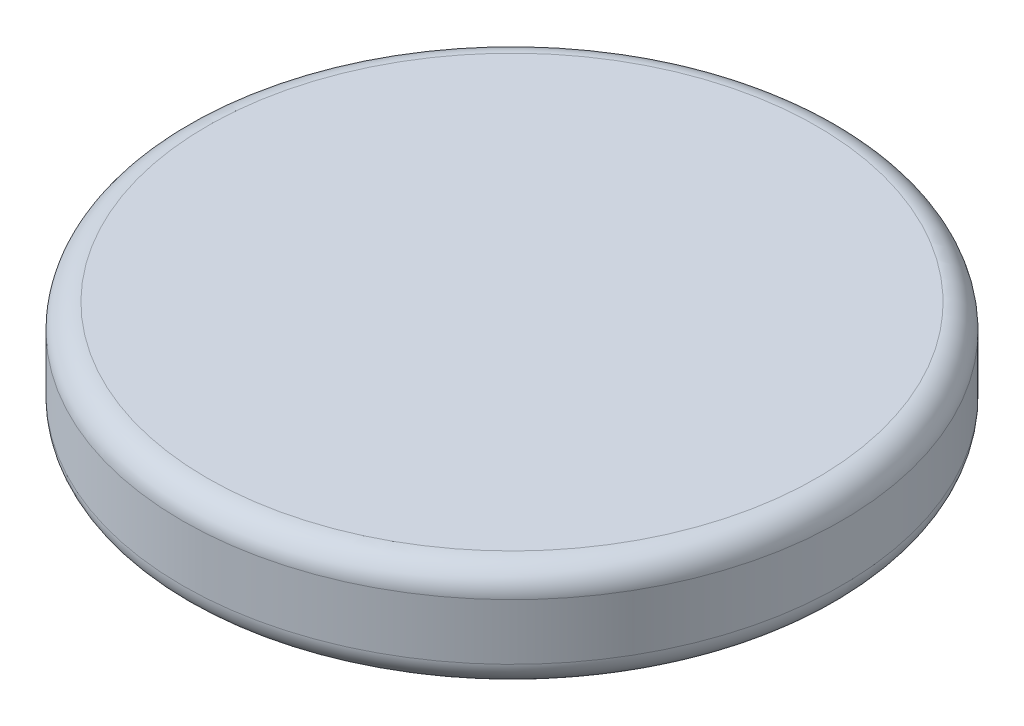
ISO-10303-21;
HEADER;
FILE_DESCRIPTION(('STEP AP214'),'2;1');
FILE_NAME('part.step','',(''),(''),'','','');
FILE_SCHEMA(('AUTOMOTIVE_DESIGN { 1 0 10303 214 1 1 1 1 }'));
ENDSEC;
DATA;
#1=APPLICATION_CONTEXT('core data for automotive mechanical design processes');
#2=APPLICATION_PROTOCOL_DEFINITION('international standard','automotive_design',2000,#1);
#3=PRODUCT_CONTEXT('',#1,'mechanical');
#4=PRODUCT('Part','Part','',(#3));
#5=PRODUCT_RELATED_PRODUCT_CATEGORY('part','',(#4));
#6=PRODUCT_DEFINITION_FORMATION('','',#4);
#7=PRODUCT_DEFINITION_CONTEXT('part definition',#1,'design');
#8=PRODUCT_DEFINITION('design','',#6,#7);
#9=PRODUCT_DEFINITION_SHAPE('','',#8);
#10=(LENGTH_UNIT() NAMED_UNIT(*) SI_UNIT(.MILLI.,.METRE.));
#11=(NAMED_UNIT(*) PLANE_ANGLE_UNIT() SI_UNIT($,.RADIAN.));
#12=(NAMED_UNIT(*) SI_UNIT($,.STERADIAN.) SOLID_ANGLE_UNIT());
#13=UNCERTAINTY_MEASURE_WITH_UNIT(LENGTH_MEASURE(1.E-05),#10,'distance_accuracy_value','');
#14=(GEOMETRIC_REPRESENTATION_CONTEXT(3) GLOBAL_UNCERTAINTY_ASSIGNED_CONTEXT((#13)) GLOBAL_UNIT_ASSIGNED_CONTEXT((#10,
#11,#12)) REPRESENTATION_CONTEXT('',''));
#15=CARTESIAN_POINT('',(0.,0.,0.));
#16=DIRECTION('',(0.,0.,1.));
#17=DIRECTION('',(1.,0.,0.));
#18=AXIS2_PLACEMENT_3D('',#15,#16,#17);
#19=CARTESIAN_POINT('',(0.,3.2,0.));
#20=DIRECTION('',(0.,-1.,0.));
#21=DIRECTION('',(0.,0.,-1.));
#22=AXIS2_PLACEMENT_3D('',#19,#20,#21);
#23=CYLINDRICAL_SURFACE('',#22,10.);
#24=CARTESIAN_POINT('',(0.,2.45,0.));
#25=DIRECTION('',(0.,1.,0.));
#26=DIRECTION('',(0.,0.,1.));
#27=AXIS2_PLACEMENT_3D('',#24,#25,#26);
#28=CIRCLE('',#27,10.);
#29=CARTESIAN_POINT('',(0.,2.45,10.));
#30=VERTEX_POINT('',#29);
#31=EDGE_CURVE('E51',#30,#30,#28,.F.);
#32=ORIENTED_EDGE('',*,*,#31,.T.);
#33=EDGE_LOOP('',(#32));
#34=FACE_BOUND('',#33,.T.);
#35=CARTESIAN_POINT('',(0.,0.75,0.));
#36=DIRECTION('',(0.,1.,0.));
#37=DIRECTION('',(0.,0.,1.));
#38=AXIS2_PLACEMENT_3D('',#35,#36,#37);
#39=CIRCLE('',#38,10.);
#40=CARTESIAN_POINT('',(0.,0.75,10.));
#41=VERTEX_POINT('',#40);
#42=EDGE_CURVE('E56',#41,#41,#39,.T.);
#43=ORIENTED_EDGE('',*,*,#42,.T.);
#44=EDGE_LOOP('',(#43));
#45=FACE_BOUND('',#44,.T.);
#46=ADVANCED_FACE('F43',(#34,#45),#23,.T.);
#47=CARTESIAN_POINT('',(0.,3.2,0.));
#48=DIRECTION('',(0.,1.,0.));
#49=DIRECTION('',(0.,0.,1.));
#50=AXIS2_PLACEMENT_3D('',#47,#48,#49);
#51=PLANE('',#50);
#52=CARTESIAN_POINT('',(0.,3.2,0.));
#53=DIRECTION('',(0.,1.,0.));
#54=DIRECTION('',(0.,0.,1.));
#55=AXIS2_PLACEMENT_3D('',#52,#53,#54);
#56=CIRCLE('',#55,9.25);
#57=CARTESIAN_POINT('',(0.,3.2,9.25));
#58=VERTEX_POINT('',#57);
#59=EDGE_CURVE('E61',#58,#58,#56,.T.);
#60=ORIENTED_EDGE('',*,*,#59,.T.);
#61=EDGE_LOOP('',(#60));
#62=FACE_BOUND('',#61,.T.);
#63=ADVANCED_FACE('F68',(#62),#51,.T.);
#64=CARTESIAN_POINT('',(0.,0.,0.));
#65=DIRECTION('',(0.,1.,0.));
#66=DIRECTION('',(0.,0.,1.));
#67=AXIS2_PLACEMENT_3D('',#64,#65,#66);
#68=PLANE('',#67);
#69=CARTESIAN_POINT('',(0.,0.,0.));
#70=DIRECTION('',(0.,1.,0.));
#71=DIRECTION('',(0.,0.,1.));
#72=AXIS2_PLACEMENT_3D('',#69,#70,#71);
#73=CIRCLE('',#72,9.25);
#74=CARTESIAN_POINT('',(0.,0.,9.25));
#75=VERTEX_POINT('',#74);
#76=EDGE_CURVE('E10',#75,#75,#73,.F.);
#77=ORIENTED_EDGE('',*,*,#76,.T.);
#78=EDGE_LOOP('',(#77));
#79=FACE_BOUND('',#78,.T.);
#80=ADVANCED_FACE('F72',(#79),#68,.F.);
#81=CARTESIAN_POINT('',(0.,2.45,0.));
#82=DIRECTION('',(0.,1.,0.));
#83=DIRECTION('',(0.,0.,1.));
#84=AXIS2_PLACEMENT_3D('',#81,#82,#83);
#85=TOROIDAL_SURFACE('',#84,9.25,0.75);
#86=ORIENTED_EDGE('',*,*,#31,.F.);
#87=EDGE_LOOP('',(#86));
#88=FACE_BOUND('',#87,.T.);
#89=ORIENTED_EDGE('',*,*,#59,.F.);
#90=EDGE_LOOP('',(#89));
#91=FACE_BOUND('',#90,.T.);
#92=ADVANCED_FACE('F70',(#88,#91),#85,.T.);
#93=CARTESIAN_POINT('',(0.,0.75,0.));
#94=DIRECTION('',(0.,1.,0.));
#95=DIRECTION('',(0.,0.,1.));
#96=AXIS2_PLACEMENT_3D('',#93,#94,#95);
#97=TOROIDAL_SURFACE('',#96,9.25,0.75);
#98=ORIENTED_EDGE('',*,*,#76,.F.);
#99=EDGE_LOOP('',(#98));
#100=FACE_BOUND('',#99,.T.);
#101=ORIENTED_EDGE('',*,*,#42,.F.);
#102=EDGE_LOOP('',(#101));
#103=FACE_BOUND('',#102,.T.);
#104=ADVANCED_FACE('F45',(#100,#103),#97,.T.);
#105=CLOSED_SHELL('',(#46,#63,#80,#92,#104));
#106=MANIFOLD_SOLID_BREP('B2',#105);
#107=ADVANCED_BREP_SHAPE_REPRESENTATION('',(#18,#106),#14);
#108=SHAPE_DEFINITION_REPRESENTATION(#9,#107);
ENDSEC;
END-ISO-10303-21;
